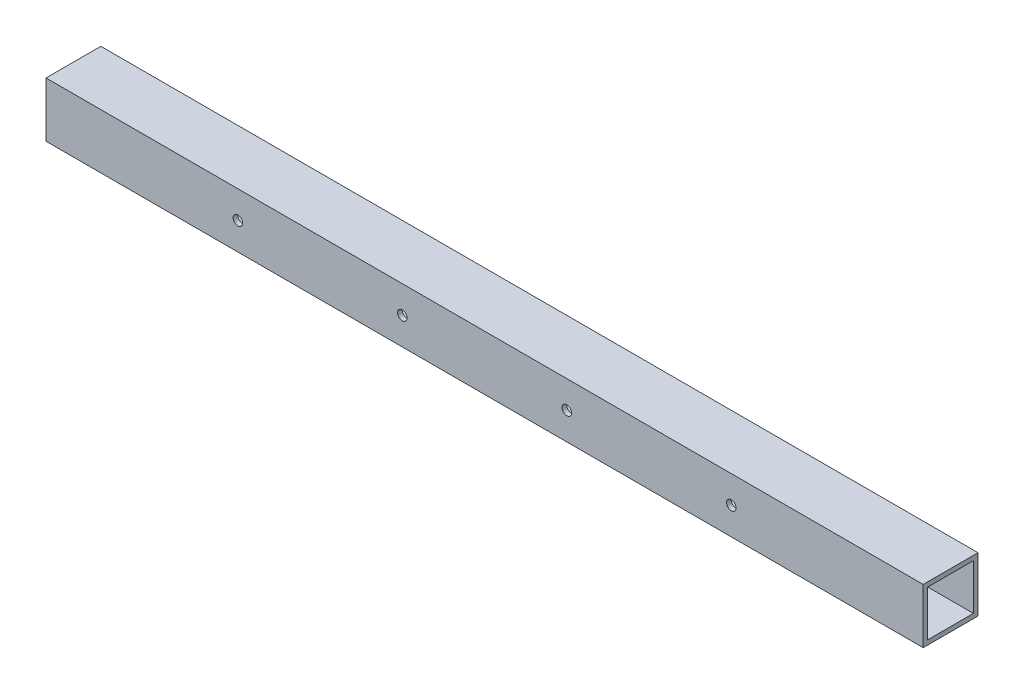
ISO-10303-21;
HEADER;
FILE_DESCRIPTION(('STEP AP214'),'2;1');
FILE_NAME('part.step','',(''),(''),'','','');
FILE_SCHEMA(('AUTOMOTIVE_DESIGN { 1 0 10303 214 1 1 1 1 }'));
ENDSEC;
DATA;
#1=APPLICATION_CONTEXT('core data for automotive mechanical design processes');
#2=APPLICATION_PROTOCOL_DEFINITION('international standard','automotive_design',2000,#1);
#3=PRODUCT_CONTEXT('',#1,'mechanical');
#4=PRODUCT('Part','Part','',(#3));
#5=PRODUCT_RELATED_PRODUCT_CATEGORY('part','',(#4));
#6=PRODUCT_DEFINITION_FORMATION('','',#4);
#7=PRODUCT_DEFINITION_CONTEXT('part definition',#1,'design');
#8=PRODUCT_DEFINITION('design','',#6,#7);
#9=PRODUCT_DEFINITION_SHAPE('','',#8);
#10=(LENGTH_UNIT() NAMED_UNIT(*) SI_UNIT(.MILLI.,.METRE.));
#11=(NAMED_UNIT(*) PLANE_ANGLE_UNIT() SI_UNIT($,.RADIAN.));
#12=(NAMED_UNIT(*) SI_UNIT($,.STERADIAN.) SOLID_ANGLE_UNIT());
#13=UNCERTAINTY_MEASURE_WITH_UNIT(LENGTH_MEASURE(1.E-05),#10,'distance_accuracy_value','');
#14=(GEOMETRIC_REPRESENTATION_CONTEXT(3) GLOBAL_UNCERTAINTY_ASSIGNED_CONTEXT((#13)) GLOBAL_UNIT_ASSIGNED_CONTEXT((#10,
#11,#12)) REPRESENTATION_CONTEXT('',''));
#15=CARTESIAN_POINT('',(0.,0.,0.));
#16=DIRECTION('',(0.,0.,1.));
#17=DIRECTION('',(1.,0.,0.));
#18=AXIS2_PLACEMENT_3D('',#15,#16,#17);
#19=CARTESIAN_POINT('',(-171.45,0.,19.05));
#20=DIRECTION('',(0.,0.,-1.));
#21=DIRECTION('',(-1.,0.,0.));
#22=AXIS2_PLACEMENT_3D('',#19,#20,#21);
#23=CYLINDRICAL_SURFACE('',#22,3.302);
#24=CARTESIAN_POINT('',(-171.45,0.,15.875));
#25=DIRECTION('',(0.,0.,-1.));
#26=DIRECTION('',(-1.,0.,0.));
#27=AXIS2_PLACEMENT_3D('',#24,#25,#26);
#28=CIRCLE('',#27,3.302);
#29=CARTESIAN_POINT('',(-174.752,0.,15.875));
#30=VERTEX_POINT('',#29);
#31=EDGE_CURVE('E91',#30,#30,#28,.F.);
#32=ORIENTED_EDGE('',*,*,#31,.F.);
#33=EDGE_LOOP('',(#32));
#34=FACE_BOUND('',#33,.T.);
#35=CARTESIAN_POINT('',(-171.45,0.,19.05));
#36=DIRECTION('',(0.,0.,-1.));
#37=DIRECTION('',(-1.,0.,0.));
#38=AXIS2_PLACEMENT_3D('',#35,#36,#37);
#39=CIRCLE('',#38,3.302);
#40=CARTESIAN_POINT('',(-174.752,0.,19.05));
#41=VERTEX_POINT('',#40);
#42=EDGE_CURVE('E120',#41,#41,#39,.T.);
#43=ORIENTED_EDGE('',*,*,#42,.F.);
#44=EDGE_LOOP('',(#43));
#45=FACE_BOUND('',#44,.T.);
#46=ADVANCED_FACE('F17',(#34,#45),#23,.F.);
#47=CARTESIAN_POINT('',(-57.15,0.,19.05));
#48=DIRECTION('',(0.,0.,-1.));
#49=DIRECTION('',(-1.,0.,0.));
#50=AXIS2_PLACEMENT_3D('',#47,#48,#49);
#51=CYLINDRICAL_SURFACE('',#50,3.302);
#52=CARTESIAN_POINT('',(-57.15,0.,15.875));
#53=DIRECTION('',(0.,0.,-1.));
#54=DIRECTION('',(-1.,0.,0.));
#55=AXIS2_PLACEMENT_3D('',#52,#53,#54);
#56=CIRCLE('',#55,3.302);
#57=CARTESIAN_POINT('',(-60.452,0.,15.875));
#58=VERTEX_POINT('',#57);
#59=EDGE_CURVE('E156',#58,#58,#56,.F.);
#60=ORIENTED_EDGE('',*,*,#59,.F.);
#61=EDGE_LOOP('',(#60));
#62=FACE_BOUND('',#61,.T.);
#63=CARTESIAN_POINT('',(-57.15,0.,19.05));
#64=DIRECTION('',(0.,0.,-1.));
#65=DIRECTION('',(-1.,0.,0.));
#66=AXIS2_PLACEMENT_3D('',#63,#64,#65);
#67=CIRCLE('',#66,3.302);
#68=CARTESIAN_POINT('',(-60.452,0.,19.05));
#69=VERTEX_POINT('',#68);
#70=EDGE_CURVE('E146',#69,#69,#67,.T.);
#71=ORIENTED_EDGE('',*,*,#70,.F.);
#72=EDGE_LOOP('',(#71));
#73=FACE_BOUND('',#72,.T.);
#74=ADVANCED_FACE('F361',(#62,#73),#51,.F.);
#75=CARTESIAN_POINT('',(171.45,0.,19.05));
#76=DIRECTION('',(0.,0.,1.));
#77=DIRECTION('',(1.,0.,0.));
#78=AXIS2_PLACEMENT_3D('',#75,#76,#77);
#79=CYLINDRICAL_SURFACE('',#78,3.302);
#80=CARTESIAN_POINT('',(171.45,0.,15.875));
#81=DIRECTION('',(0.,0.,1.));
#82=DIRECTION('',(1.,0.,0.));
#83=AXIS2_PLACEMENT_3D('',#80,#81,#82);
#84=CIRCLE('',#83,3.302);
#85=CARTESIAN_POINT('',(174.752,0.,15.875));
#86=VERTEX_POINT('',#85);
#87=EDGE_CURVE('E153',#86,#86,#84,.T.);
#88=ORIENTED_EDGE('',*,*,#87,.F.);
#89=EDGE_LOOP('',(#88));
#90=FACE_BOUND('',#89,.T.);
#91=CARTESIAN_POINT('',(171.45,0.,19.05));
#92=DIRECTION('',(0.,0.,1.));
#93=DIRECTION('',(1.,0.,0.));
#94=AXIS2_PLACEMENT_3D('',#91,#92,#93);
#95=CIRCLE('',#94,3.302);
#96=CARTESIAN_POINT('',(174.752,0.,19.05));
#97=VERTEX_POINT('',#96);
#98=EDGE_CURVE('E143',#97,#97,#95,.F.);
#99=ORIENTED_EDGE('',*,*,#98,.F.);
#100=EDGE_LOOP('',(#99));
#101=FACE_BOUND('',#100,.T.);
#102=ADVANCED_FACE('F351',(#90,#101),#79,.F.);
#103=CARTESIAN_POINT('',(57.15,0.,19.05));
#104=DIRECTION('',(0.,0.,1.));
#105=DIRECTION('',(1.,0.,0.));
#106=AXIS2_PLACEMENT_3D('',#103,#104,#105);
#107=CYLINDRICAL_SURFACE('',#106,3.302);
#108=CARTESIAN_POINT('',(57.15,0.,15.875));
#109=DIRECTION('',(0.,0.,1.));
#110=DIRECTION('',(1.,0.,0.));
#111=AXIS2_PLACEMENT_3D('',#108,#109,#110);
#112=CIRCLE('',#111,3.302);
#113=CARTESIAN_POINT('',(60.452,0.,15.875));
#114=VERTEX_POINT('',#113);
#115=EDGE_CURVE('E123',#114,#114,#112,.T.);
#116=ORIENTED_EDGE('',*,*,#115,.F.);
#117=EDGE_LOOP('',(#116));
#118=FACE_BOUND('',#117,.T.);
#119=CARTESIAN_POINT('',(57.15,0.,19.05));
#120=DIRECTION('',(0.,0.,1.));
#121=DIRECTION('',(1.,0.,0.));
#122=AXIS2_PLACEMENT_3D('',#119,#120,#121);
#123=CIRCLE('',#122,3.302);
#124=CARTESIAN_POINT('',(60.452,0.,19.05));
#125=VERTEX_POINT('',#124);
#126=EDGE_CURVE('E116',#125,#125,#123,.F.);
#127=ORIENTED_EDGE('',*,*,#126,.F.);
#128=EDGE_LOOP('',(#127));
#129=FACE_BOUND('',#128,.T.);
#130=ADVANCED_FACE('F179',(#118,#129),#107,.F.);
#131=CARTESIAN_POINT('',(-171.45,0.,19.05));
#132=DIRECTION('',(0.,0.,-1.));
#133=DIRECTION('',(-1.,0.,0.));
#134=AXIS2_PLACEMENT_3D('',#131,#132,#133);
#135=CYLINDRICAL_SURFACE('',#134,3.302);
#136=CARTESIAN_POINT('',(-171.45,0.,-15.875));
#137=DIRECTION('',(0.,0.,-1.));
#138=DIRECTION('',(-1.,0.,0.));
#139=AXIS2_PLACEMENT_3D('',#136,#137,#138);
#140=CIRCLE('',#139,3.302);
#141=CARTESIAN_POINT('',(-174.752,0.,-15.875));
#142=VERTEX_POINT('',#141);
#143=EDGE_CURVE('E20',#142,#142,#140,.T.);
#144=ORIENTED_EDGE('',*,*,#143,.F.);
#145=EDGE_LOOP('',(#144));
#146=FACE_BOUND('',#145,.T.);
#147=CARTESIAN_POINT('',(-171.45,0.,-19.05));
#148=DIRECTION('',(0.,0.,-1.));
#149=DIRECTION('',(-1.,0.,0.));
#150=AXIS2_PLACEMENT_3D('',#147,#148,#149);
#151=CIRCLE('',#150,3.302);
#152=CARTESIAN_POINT('',(-174.752,0.,-19.05));
#153=VERTEX_POINT('',#152);
#154=EDGE_CURVE('E137',#153,#153,#151,.F.);
#155=ORIENTED_EDGE('',*,*,#154,.F.);
#156=EDGE_LOOP('',(#155));
#157=FACE_BOUND('',#156,.T.);
#158=ADVANCED_FACE('F175',(#146,#157),#135,.F.);
#159=CARTESIAN_POINT('',(-57.15,0.,19.05));
#160=DIRECTION('',(0.,0.,-1.));
#161=DIRECTION('',(-1.,0.,0.));
#162=AXIS2_PLACEMENT_3D('',#159,#160,#161);
#163=CYLINDRICAL_SURFACE('',#162,3.302);
#164=CARTESIAN_POINT('',(-57.15,0.,-15.875));
#165=DIRECTION('',(0.,0.,-1.));
#166=DIRECTION('',(-1.,0.,0.));
#167=AXIS2_PLACEMENT_3D('',#164,#165,#166);
#168=CIRCLE('',#167,3.302);
#169=CARTESIAN_POINT('',(-60.452,0.,-15.875));
#170=VERTEX_POINT('',#169);
#171=EDGE_CURVE('E165',#170,#170,#168,.T.);
#172=ORIENTED_EDGE('',*,*,#171,.F.);
#173=EDGE_LOOP('',(#172));
#174=FACE_BOUND('',#173,.T.);
#175=CARTESIAN_POINT('',(-57.15,0.,-19.05));
#176=DIRECTION('',(0.,0.,-1.));
#177=DIRECTION('',(-1.,0.,0.));
#178=AXIS2_PLACEMENT_3D('',#175,#176,#177);
#179=CIRCLE('',#178,3.302);
#180=CARTESIAN_POINT('',(-60.452,0.,-19.05));
#181=VERTEX_POINT('',#180);
#182=EDGE_CURVE('E134',#181,#181,#179,.F.);
#183=ORIENTED_EDGE('',*,*,#182,.F.);
#184=EDGE_LOOP('',(#183));
#185=FACE_BOUND('',#184,.T.);
#186=ADVANCED_FACE('F178',(#174,#185),#163,.F.);
#187=CARTESIAN_POINT('',(171.45,0.,19.05));
#188=DIRECTION('',(0.,0.,1.));
#189=DIRECTION('',(1.,0.,0.));
#190=AXIS2_PLACEMENT_3D('',#187,#188,#189);
#191=CYLINDRICAL_SURFACE('',#190,3.302);
#192=CARTESIAN_POINT('',(171.45,0.,-19.05));
#193=DIRECTION('',(0.,0.,1.));
#194=DIRECTION('',(1.,0.,0.));
#195=AXIS2_PLACEMENT_3D('',#192,#193,#194);
#196=CIRCLE('',#195,3.302);
#197=CARTESIAN_POINT('',(174.752,0.,-19.05));
#198=VERTEX_POINT('',#197);
#199=EDGE_CURVE('E131',#198,#198,#196,.T.);
#200=ORIENTED_EDGE('',*,*,#199,.F.);
#201=EDGE_LOOP('',(#200));
#202=FACE_BOUND('',#201,.T.);
#203=CARTESIAN_POINT('',(171.45,0.,-15.875));
#204=DIRECTION('',(0.,0.,1.));
#205=DIRECTION('',(1.,0.,0.));
#206=AXIS2_PLACEMENT_3D('',#203,#204,#205);
#207=CIRCLE('',#206,3.302);
#208=CARTESIAN_POINT('',(174.752,0.,-15.875));
#209=VERTEX_POINT('',#208);
#210=EDGE_CURVE('E163',#209,#209,#207,.F.);
#211=ORIENTED_EDGE('',*,*,#210,.F.);
#212=EDGE_LOOP('',(#211));
#213=FACE_BOUND('',#212,.T.);
#214=ADVANCED_FACE('F317',(#202,#213),#191,.F.);
#215=CARTESIAN_POINT('',(57.15,0.,19.05));
#216=DIRECTION('',(0.,0.,1.));
#217=DIRECTION('',(1.,0.,0.));
#218=AXIS2_PLACEMENT_3D('',#215,#216,#217);
#219=CYLINDRICAL_SURFACE('',#218,3.302);
#220=CARTESIAN_POINT('',(57.15,0.,-19.05));
#221=DIRECTION('',(0.,0.,1.));
#222=DIRECTION('',(1.,0.,0.));
#223=AXIS2_PLACEMENT_3D('',#220,#221,#222);
#224=CIRCLE('',#223,3.302);
#225=CARTESIAN_POINT('',(60.452,0.,-19.05));
#226=VERTEX_POINT('',#225);
#227=EDGE_CURVE('E127',#226,#226,#224,.T.);
#228=ORIENTED_EDGE('',*,*,#227,.F.);
#229=EDGE_LOOP('',(#228));
#230=FACE_BOUND('',#229,.T.);
#231=CARTESIAN_POINT('',(57.15,0.,-15.875));
#232=DIRECTION('',(0.,0.,1.));
#233=DIRECTION('',(1.,0.,0.));
#234=AXIS2_PLACEMENT_3D('',#231,#232,#233);
#235=CIRCLE('',#234,3.302);
#236=CARTESIAN_POINT('',(60.452,0.,-15.875));
#237=VERTEX_POINT('',#236);
#238=EDGE_CURVE('E126',#237,#237,#235,.F.);
#239=ORIENTED_EDGE('',*,*,#238,.F.);
#240=EDGE_LOOP('',(#239));
#241=FACE_BOUND('',#240,.T.);
#242=ADVANCED_FACE('F308',(#230,#241),#219,.F.);
#243=CARTESIAN_POINT('',(-304.8,-19.05,19.05));
#244=DIRECTION('',(0.,-1.,0.));
#245=DIRECTION('',(0.,0.,-1.));
#246=AXIS2_PLACEMENT_3D('',#243,#244,#245);
#247=PLANE('',#246);
#248=DIRECTION('',(1.,0.,0.));
#249=VECTOR('',#248,1.);
#250=CARTESIAN_POINT('',(-304.8,-19.05,19.05));
#251=LINE('',#250,#249);
#252=CARTESIAN_POINT('',(-304.8,-19.05,19.05));
#253=VERTEX_POINT('',#252);
#254=CARTESIAN_POINT('',(304.8,-19.05,19.05));
#255=VERTEX_POINT('',#254);
#256=EDGE_CURVE('E117',#253,#255,#251,.T.);
#257=ORIENTED_EDGE('',*,*,#256,.F.);
#258=DIRECTION('',(0.,0.,-1.));
#259=VECTOR('',#258,1.);
#260=CARTESIAN_POINT('',(-304.8,-19.05,0.));
#261=LINE('',#260,#259);
#262=CARTESIAN_POINT('',(-304.8,-19.05,-19.05));
#263=VERTEX_POINT('',#262);
#264=EDGE_CURVE('E197',#253,#263,#261,.T.);
#265=ORIENTED_EDGE('',*,*,#264,.T.);
#266=DIRECTION('',(-1.,0.,0.));
#267=VECTOR('',#266,1.);
#268=CARTESIAN_POINT('',(-304.8,-19.05,-19.05));
#269=LINE('',#268,#267);
#270=CARTESIAN_POINT('',(304.8,-19.05,-19.05));
#271=VERTEX_POINT('',#270);
#272=EDGE_CURVE('E140',#271,#263,#269,.T.);
#273=ORIENTED_EDGE('',*,*,#272,.F.);
#274=DIRECTION('',(0.,0.,-1.));
#275=VECTOR('',#274,1.);
#276=CARTESIAN_POINT('',(304.8,-19.05,0.));
#277=LINE('',#276,#275);
#278=EDGE_CURVE('E108',#255,#271,#277,.T.);
#279=ORIENTED_EDGE('',*,*,#278,.F.);
#280=EDGE_LOOP('',(#257,#265,#273,#279));
#281=FACE_BOUND('',#280,.T.);
#282=ADVANCED_FACE('F228',(#281),#247,.T.);
#283=CARTESIAN_POINT('',(-304.8,15.875,-15.875));
#284=DIRECTION('',(0.,0.,1.));
#285=DIRECTION('',(1.,0.,0.));
#286=AXIS2_PLACEMENT_3D('',#283,#284,#285);
#287=PLANE('',#286);
#288=ORIENTED_EDGE('',*,*,#238,.T.);
#289=EDGE_LOOP('',(#288));
#290=FACE_BOUND('',#289,.T.);
#291=ORIENTED_EDGE('',*,*,#210,.T.);
#292=EDGE_LOOP('',(#291));
#293=FACE_BOUND('',#292,.T.);
#294=ORIENTED_EDGE('',*,*,#171,.T.);
#295=EDGE_LOOP('',(#294));
#296=FACE_BOUND('',#295,.T.);
#297=ORIENTED_EDGE('',*,*,#143,.T.);
#298=EDGE_LOOP('',(#297));
#299=FACE_BOUND('',#298,.T.);
#300=DIRECTION('',(1.,0.,0.));
#301=VECTOR('',#300,1.);
#302=CARTESIAN_POINT('',(-304.8,15.875,-15.875));
#303=LINE('',#302,#301);
#304=CARTESIAN_POINT('',(-304.8,15.875,-15.875));
#305=VERTEX_POINT('',#304);
#306=CARTESIAN_POINT('',(304.8,15.875,-15.875));
#307=VERTEX_POINT('',#306);
#308=EDGE_CURVE('E122',#305,#307,#303,.T.);
#309=ORIENTED_EDGE('',*,*,#308,.F.);
#310=DIRECTION('',(0.,1.,0.));
#311=VECTOR('',#310,1.);
#312=CARTESIAN_POINT('',(-304.8,0.,-15.875));
#313=LINE('',#312,#311);
#314=CARTESIAN_POINT('',(-304.8,-15.875,-15.875));
#315=VERTEX_POINT('',#314);
#316=EDGE_CURVE('E199',#305,#315,#313,.F.);
#317=ORIENTED_EDGE('',*,*,#316,.T.);
#318=DIRECTION('',(1.,0.,0.));
#319=VECTOR('',#318,1.);
#320=CARTESIAN_POINT('',(-304.8,-15.875,-15.875));
#321=LINE('',#320,#319);
#322=CARTESIAN_POINT('',(304.8,-15.875,-15.875));
#323=VERTEX_POINT('',#322);
#324=EDGE_CURVE('E92',#323,#315,#321,.F.);
#325=ORIENTED_EDGE('',*,*,#324,.F.);
#326=DIRECTION('',(0.,1.,0.));
#327=VECTOR('',#326,1.);
#328=CARTESIAN_POINT('',(304.8,0.,-15.875));
#329=LINE('',#328,#327);
#330=EDGE_CURVE('E107',#307,#323,#329,.F.);
#331=ORIENTED_EDGE('',*,*,#330,.F.);
#332=EDGE_LOOP('',(#309,#317,#325,#331));
#333=FACE_BOUND('',#332,.T.);
#334=ADVANCED_FACE('F172',(#290,#293,#296,#299,#333),#287,.T.);
#335=CARTESIAN_POINT('',(-304.8,-15.875,-15.875));
#336=DIRECTION('',(0.,1.,0.));
#337=DIRECTION('',(0.,0.,1.));
#338=AXIS2_PLACEMENT_3D('',#335,#336,#337);
#339=PLANE('',#338);
#340=ORIENTED_EDGE('',*,*,#324,.T.);
#341=DIRECTION('',(0.,0.,-1.));
#342=VECTOR('',#341,1.);
#343=CARTESIAN_POINT('',(-304.8,-15.875,0.));
#344=LINE('',#343,#342);
#345=CARTESIAN_POINT('',(-304.8,-15.875,15.875));
#346=VERTEX_POINT('',#345);
#347=EDGE_CURVE('E88',#315,#346,#344,.F.);
#348=ORIENTED_EDGE('',*,*,#347,.T.);
#349=DIRECTION('',(-1.,0.,0.));
#350=VECTOR('',#349,1.);
#351=CARTESIAN_POINT('',(-304.8,-15.875,15.875));
#352=LINE('',#351,#350);
#353=CARTESIAN_POINT('',(304.8,-15.875,15.875));
#354=VERTEX_POINT('',#353);
#355=EDGE_CURVE('E80',#354,#346,#352,.T.);
#356=ORIENTED_EDGE('',*,*,#355,.F.);
#357=DIRECTION('',(0.,0.,-1.));
#358=VECTOR('',#357,1.);
#359=CARTESIAN_POINT('',(304.8,-15.875,0.));
#360=LINE('',#359,#358);
#361=EDGE_CURVE('E85',#323,#354,#360,.F.);
#362=ORIENTED_EDGE('',*,*,#361,.F.);
#363=EDGE_LOOP('',(#340,#348,#356,#362));
#364=FACE_BOUND('',#363,.T.);
#365=ADVANCED_FACE('F83',(#364),#339,.T.);
#366=CARTESIAN_POINT('',(-304.8,-15.875,15.875));
#367=DIRECTION('',(0.,0.,-1.));
#368=DIRECTION('',(-1.,0.,0.));
#369=AXIS2_PLACEMENT_3D('',#366,#367,#368);
#370=PLANE('',#369);
#371=ORIENTED_EDGE('',*,*,#115,.T.);
#372=EDGE_LOOP('',(#371));
#373=FACE_BOUND('',#372,.T.);
#374=ORIENTED_EDGE('',*,*,#87,.T.);
#375=EDGE_LOOP('',(#374));
#376=FACE_BOUND('',#375,.T.);
#377=ORIENTED_EDGE('',*,*,#59,.T.);
#378=EDGE_LOOP('',(#377));
#379=FACE_BOUND('',#378,.T.);
#380=ORIENTED_EDGE('',*,*,#31,.T.);
#381=EDGE_LOOP('',(#380));
#382=FACE_BOUND('',#381,.T.);
#383=ORIENTED_EDGE('',*,*,#355,.T.);
#384=DIRECTION('',(0.,1.,0.));
#385=VECTOR('',#384,1.);
#386=CARTESIAN_POINT('',(-304.8,0.,15.875));
#387=LINE('',#386,#385);
#388=CARTESIAN_POINT('',(-304.8,15.875,15.875));
#389=VERTEX_POINT('',#388);
#390=EDGE_CURVE('E215',#346,#389,#387,.T.);
#391=ORIENTED_EDGE('',*,*,#390,.T.);
#392=DIRECTION('',(1.,0.,0.));
#393=VECTOR('',#392,1.);
#394=CARTESIAN_POINT('',(-304.8,15.875,15.875));
#395=LINE('',#394,#393);
#396=CARTESIAN_POINT('',(304.8,15.875,15.875));
#397=VERTEX_POINT('',#396);
#398=EDGE_CURVE('E98',#397,#389,#395,.F.);
#399=ORIENTED_EDGE('',*,*,#398,.F.);
#400=DIRECTION('',(0.,1.,0.));
#401=VECTOR('',#400,1.);
#402=CARTESIAN_POINT('',(304.8,0.,15.875));
#403=LINE('',#402,#401);
#404=EDGE_CURVE('E95',#354,#397,#403,.T.);
#405=ORIENTED_EDGE('',*,*,#404,.F.);
#406=EDGE_LOOP('',(#383,#391,#399,#405));
#407=FACE_BOUND('',#406,.T.);
#408=ADVANCED_FACE('F96',(#373,#376,#379,#382,#407),#370,.T.);
#409=CARTESIAN_POINT('',(-304.8,15.875,15.875));
#410=DIRECTION('',(0.,-1.,0.));
#411=DIRECTION('',(0.,0.,-1.));
#412=AXIS2_PLACEMENT_3D('',#409,#410,#411);
#413=PLANE('',#412);
#414=ORIENTED_EDGE('',*,*,#398,.T.);
#415=DIRECTION('',(0.,0.,-1.));
#416=VECTOR('',#415,1.);
#417=CARTESIAN_POINT('',(-304.8,15.875,0.));
#418=LINE('',#417,#416);
#419=EDGE_CURVE('E212',#389,#305,#418,.T.);
#420=ORIENTED_EDGE('',*,*,#419,.T.);
#421=ORIENTED_EDGE('',*,*,#308,.T.);
#422=DIRECTION('',(0.,0.,-1.));
#423=VECTOR('',#422,1.);
#424=CARTESIAN_POINT('',(304.8,15.875,0.));
#425=LINE('',#424,#423);
#426=EDGE_CURVE('E102',#397,#307,#425,.T.);
#427=ORIENTED_EDGE('',*,*,#426,.F.);
#428=EDGE_LOOP('',(#414,#420,#421,#427));
#429=FACE_BOUND('',#428,.T.);
#430=ADVANCED_FACE('F209',(#429),#413,.T.);
#431=CARTESIAN_POINT('',(-304.8,19.05,19.05));
#432=DIRECTION('',(0.,0.,1.));
#433=DIRECTION('',(1.,0.,0.));
#434=AXIS2_PLACEMENT_3D('',#431,#432,#433);
#435=PLANE('',#434);
#436=ORIENTED_EDGE('',*,*,#126,.T.);
#437=EDGE_LOOP('',(#436));
#438=FACE_BOUND('',#437,.T.);
#439=ORIENTED_EDGE('',*,*,#98,.T.);
#440=EDGE_LOOP('',(#439));
#441=FACE_BOUND('',#440,.T.);
#442=ORIENTED_EDGE('',*,*,#70,.T.);
#443=EDGE_LOOP('',(#442));
#444=FACE_BOUND('',#443,.T.);
#445=ORIENTED_EDGE('',*,*,#42,.T.);
#446=EDGE_LOOP('',(#445));
#447=FACE_BOUND('',#446,.T.);
#448=DIRECTION('',(1.,0.,0.));
#449=VECTOR('',#448,1.);
#450=CARTESIAN_POINT('',(-304.8,19.05,19.05));
#451=LINE('',#450,#449);
#452=CARTESIAN_POINT('',(-304.8,19.05,19.05));
#453=VERTEX_POINT('',#452);
#454=CARTESIAN_POINT('',(304.8,19.05,19.05));
#455=VERTEX_POINT('',#454);
#456=EDGE_CURVE('E219',#453,#455,#451,.T.);
#457=ORIENTED_EDGE('',*,*,#456,.F.);
#458=DIRECTION('',(0.,1.,0.));
#459=VECTOR('',#458,1.);
#460=CARTESIAN_POINT('',(-304.8,0.,19.05));
#461=LINE('',#460,#459);
#462=EDGE_CURVE('E130',#453,#253,#461,.F.);
#463=ORIENTED_EDGE('',*,*,#462,.T.);
#464=ORIENTED_EDGE('',*,*,#256,.T.);
#465=DIRECTION('',(0.,1.,0.));
#466=VECTOR('',#465,1.);
#467=CARTESIAN_POINT('',(304.8,0.,19.05));
#468=LINE('',#467,#466);
#469=EDGE_CURVE('E110',#455,#255,#468,.F.);
#470=ORIENTED_EDGE('',*,*,#469,.F.);
#471=EDGE_LOOP('',(#457,#463,#464,#470));
#472=FACE_BOUND('',#471,.T.);
#473=ADVANCED_FACE('F230',(#438,#441,#444,#447,#472),#435,.T.);
#474=CARTESIAN_POINT('',(304.8,0.,0.));
#475=DIRECTION('',(1.,0.,0.));
#476=DIRECTION('',(0.,0.,-1.));
#477=AXIS2_PLACEMENT_3D('',#474,#475,#476);
#478=PLANE('',#477);
#479=ORIENTED_EDGE('',*,*,#426,.T.);
#480=ORIENTED_EDGE('',*,*,#330,.T.);
#481=ORIENTED_EDGE('',*,*,#361,.T.);
#482=ORIENTED_EDGE('',*,*,#404,.T.);
#483=EDGE_LOOP('',(#479,#480,#481,#482));
#484=FACE_BOUND('',#483,.T.);
#485=DIRECTION('',(0.,1.,0.));
#486=VECTOR('',#485,1.);
#487=CARTESIAN_POINT('',(304.8,-19.05,-19.05));
#488=LINE('',#487,#486);
#489=CARTESIAN_POINT('',(304.8,19.05,-19.05));
#490=VERTEX_POINT('',#489);
#491=EDGE_CURVE('E190',#490,#271,#488,.F.);
#492=ORIENTED_EDGE('',*,*,#491,.F.);
#493=DIRECTION('',(0.,0.,1.));
#494=VECTOR('',#493,1.);
#495=CARTESIAN_POINT('',(304.8,19.05,-19.05));
#496=LINE('',#495,#494);
#497=EDGE_CURVE('E222',#455,#490,#496,.F.);
#498=ORIENTED_EDGE('',*,*,#497,.F.);
#499=ORIENTED_EDGE('',*,*,#469,.T.);
#500=ORIENTED_EDGE('',*,*,#278,.T.);
#501=EDGE_LOOP('',(#492,#498,#499,#500));
#502=FACE_BOUND('',#501,.T.);
#503=ADVANCED_FACE('F104',(#484,#502),#478,.T.);
#504=CARTESIAN_POINT('',(-304.8,-19.05,-19.05));
#505=DIRECTION('',(0.,0.,-1.));
#506=DIRECTION('',(-1.,0.,0.));
#507=AXIS2_PLACEMENT_3D('',#504,#505,#506);
#508=PLANE('',#507);
#509=ORIENTED_EDGE('',*,*,#227,.T.);
#510=EDGE_LOOP('',(#509));
#511=FACE_BOUND('',#510,.T.);
#512=ORIENTED_EDGE('',*,*,#199,.T.);
#513=EDGE_LOOP('',(#512));
#514=FACE_BOUND('',#513,.T.);
#515=ORIENTED_EDGE('',*,*,#182,.T.);
#516=EDGE_LOOP('',(#515));
#517=FACE_BOUND('',#516,.T.);
#518=ORIENTED_EDGE('',*,*,#154,.T.);
#519=EDGE_LOOP('',(#518));
#520=FACE_BOUND('',#519,.T.);
#521=ORIENTED_EDGE('',*,*,#272,.T.);
#522=DIRECTION('',(0.,1.,0.));
#523=VECTOR('',#522,1.);
#524=CARTESIAN_POINT('',(-304.8,0.,-19.05));
#525=LINE('',#524,#523);
#526=CARTESIAN_POINT('',(-304.8,19.05,-19.05));
#527=VERTEX_POINT('',#526);
#528=EDGE_CURVE('E35',#263,#527,#525,.T.);
#529=ORIENTED_EDGE('',*,*,#528,.T.);
#530=DIRECTION('',(1.,0.,0.));
#531=VECTOR('',#530,1.);
#532=CARTESIAN_POINT('',(-304.8,19.05,-19.05));
#533=LINE('',#532,#531);
#534=EDGE_CURVE('E26',#490,#527,#533,.F.);
#535=ORIENTED_EDGE('',*,*,#534,.F.);
#536=ORIENTED_EDGE('',*,*,#491,.T.);
#537=EDGE_LOOP('',(#521,#529,#535,#536));
#538=FACE_BOUND('',#537,.T.);
#539=ADVANCED_FACE('F183',(#511,#514,#517,#520,#538),#508,.T.);
#540=CARTESIAN_POINT('',(-304.8,0.,0.));
#541=DIRECTION('',(1.,0.,0.));
#542=DIRECTION('',(0.,0.,-1.));
#543=AXIS2_PLACEMENT_3D('',#540,#541,#542);
#544=PLANE('',#543);
#545=ORIENTED_EDGE('',*,*,#390,.F.);
#546=ORIENTED_EDGE('',*,*,#347,.F.);
#547=ORIENTED_EDGE('',*,*,#316,.F.);
#548=ORIENTED_EDGE('',*,*,#419,.F.);
#549=EDGE_LOOP('',(#545,#546,#547,#548));
#550=FACE_BOUND('',#549,.T.);
#551=ORIENTED_EDGE('',*,*,#264,.F.);
#552=ORIENTED_EDGE('',*,*,#462,.F.);
#553=DIRECTION('',(0.,0.,1.));
#554=VECTOR('',#553,1.);
#555=CARTESIAN_POINT('',(-304.8,19.05,-19.05));
#556=LINE('',#555,#554);
#557=EDGE_CURVE('E11',#527,#453,#556,.T.);
#558=ORIENTED_EDGE('',*,*,#557,.F.);
#559=ORIENTED_EDGE('',*,*,#528,.F.);
#560=EDGE_LOOP('',(#551,#552,#558,#559));
#561=FACE_BOUND('',#560,.T.);
#562=ADVANCED_FACE('F185',(#550,#561),#544,.F.);
#563=CARTESIAN_POINT('',(-304.8,19.05,-19.05));
#564=DIRECTION('',(0.,1.,0.));
#565=DIRECTION('',(0.,0.,1.));
#566=AXIS2_PLACEMENT_3D('',#563,#564,#565);
#567=PLANE('',#566);
#568=ORIENTED_EDGE('',*,*,#534,.T.);
#569=ORIENTED_EDGE('',*,*,#557,.T.);
#570=ORIENTED_EDGE('',*,*,#456,.T.);
#571=ORIENTED_EDGE('',*,*,#497,.T.);
#572=EDGE_LOOP('',(#568,#569,#570,#571));
#573=FACE_BOUND('',#572,.T.);
#574=ADVANCED_FACE('F226',(#573),#567,.T.);
#575=CLOSED_SHELL('',(#46,#74,#102,#130,#158,#186,#214,#242,#282,#334,#365,#408,#430,#473,#503,
#539,#562,#574));
#576=MANIFOLD_SOLID_BREP('B1',#575);
#577=ADVANCED_BREP_SHAPE_REPRESENTATION('',(#18,#576),#14);
#578=SHAPE_DEFINITION_REPRESENTATION(#9,#577);
ENDSEC;
END-ISO-10303-21;
